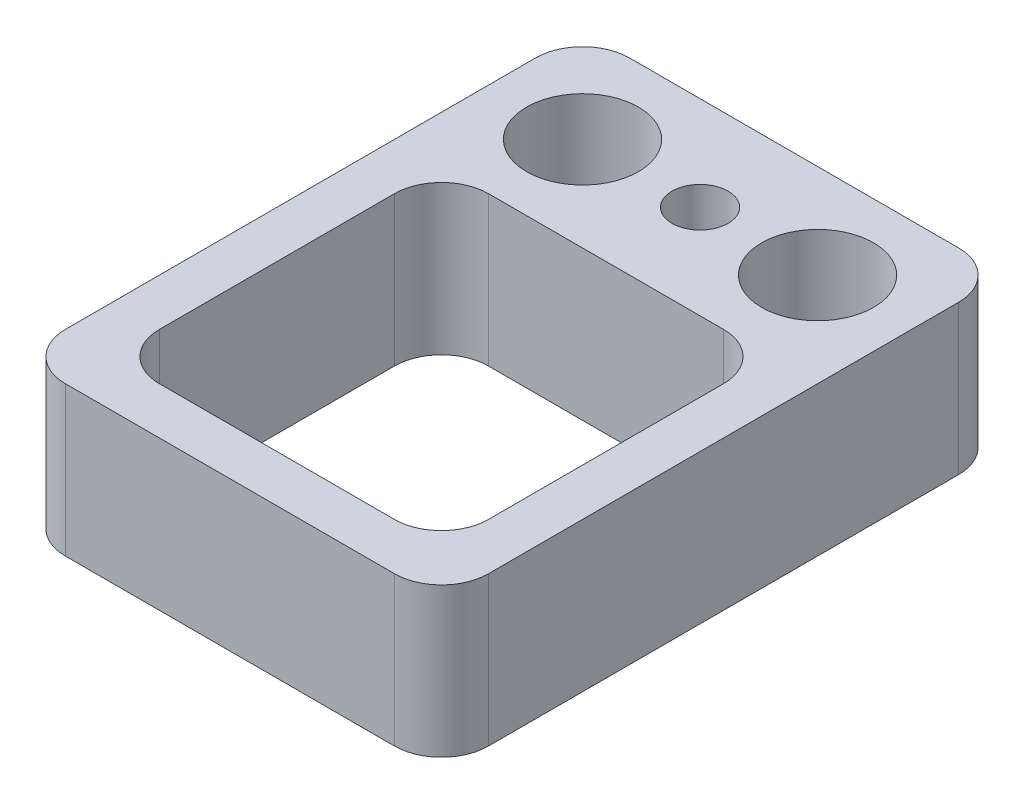
ISO-10303-21;
HEADER;
FILE_DESCRIPTION(('STEP AP214'),'2;1');
FILE_NAME('part.step','',(''),(''),'','','');
FILE_SCHEMA(('AUTOMOTIVE_DESIGN { 1 0 10303 214 1 1 1 1 }'));
ENDSEC;
DATA;
#1=APPLICATION_CONTEXT('core data for automotive mechanical design processes');
#2=APPLICATION_PROTOCOL_DEFINITION('international standard','automotive_design',2000,#1);
#3=PRODUCT_CONTEXT('',#1,'mechanical');
#4=PRODUCT('Part','Part','',(#3));
#5=PRODUCT_RELATED_PRODUCT_CATEGORY('part','',(#4));
#6=PRODUCT_DEFINITION_FORMATION('','',#4);
#7=PRODUCT_DEFINITION_CONTEXT('part definition',#1,'design');
#8=PRODUCT_DEFINITION('design','',#6,#7);
#9=PRODUCT_DEFINITION_SHAPE('','',#8);
#10=(LENGTH_UNIT() NAMED_UNIT(*) SI_UNIT(.MILLI.,.METRE.));
#11=(NAMED_UNIT(*) PLANE_ANGLE_UNIT() SI_UNIT($,.RADIAN.));
#12=(NAMED_UNIT(*) SI_UNIT($,.STERADIAN.) SOLID_ANGLE_UNIT());
#13=UNCERTAINTY_MEASURE_WITH_UNIT(LENGTH_MEASURE(1.E-05),#10,'distance_accuracy_value','');
#14=(GEOMETRIC_REPRESENTATION_CONTEXT(3) GLOBAL_UNCERTAINTY_ASSIGNED_CONTEXT((#13)) GLOBAL_UNIT_ASSIGNED_CONTEXT((#10,
#11,#12)) REPRESENTATION_CONTEXT('',''));
#15=CARTESIAN_POINT('',(0.,0.,0.));
#16=DIRECTION('',(0.,0.,1.));
#17=DIRECTION('',(1.,0.,0.));
#18=AXIS2_PLACEMENT_3D('',#15,#16,#17);
#19=CARTESIAN_POINT('',(-4.5,3.175,6.));
#20=DIRECTION('',(1.,0.,0.));
#21=DIRECTION('',(0.,0.,-1.));
#22=AXIS2_PLACEMENT_3D('',#19,#20,#21);
#23=PLANE('',#22);
#24=DIRECTION('',(0.,0.,1.));
#25=VECTOR('',#24,1.);
#26=CARTESIAN_POINT('',(-4.5,0.,6.));
#27=LINE('',#26,#25);
#28=CARTESIAN_POINT('',(-4.5,0.,-5.));
#29=VERTEX_POINT('',#28);
#30=CARTESIAN_POINT('',(-4.5,0.,5.));
#31=VERTEX_POINT('',#30);
#32=EDGE_CURVE('E184',#29,#31,#27,.T.);
#33=ORIENTED_EDGE('',*,*,#32,.T.);
#34=DIRECTION('',(0.,-1.,0.));
#35=VECTOR('',#34,1.);
#36=CARTESIAN_POINT('',(-4.5,3.175,5.));
#37=LINE('',#36,#35);
#38=CARTESIAN_POINT('',(-4.5,3.175,5.));
#39=VERTEX_POINT('',#38);
#40=EDGE_CURVE('E256',#31,#39,#37,.F.);
#41=ORIENTED_EDGE('',*,*,#40,.T.);
#42=DIRECTION('',(0.,0.,1.));
#43=VECTOR('',#42,1.);
#44=CARTESIAN_POINT('',(-4.5,3.175,6.));
#45=LINE('',#44,#43);
#46=CARTESIAN_POINT('',(-4.5,3.175,-5.));
#47=VERTEX_POINT('',#46);
#48=EDGE_CURVE('E185',#47,#39,#45,.T.);
#49=ORIENTED_EDGE('',*,*,#48,.F.);
#50=DIRECTION('',(0.,-1.,0.));
#51=VECTOR('',#50,1.);
#52=CARTESIAN_POINT('',(-4.5,3.175,-5.));
#53=LINE('',#52,#51);
#54=EDGE_CURVE('E253',#47,#29,#53,.T.);
#55=ORIENTED_EDGE('',*,*,#54,.T.);
#56=EDGE_LOOP('',(#33,#41,#49,#55));
#57=FACE_BOUND('',#56,.T.);
#58=ADVANCED_FACE('F31',(#57),#23,.F.);
#59=CARTESIAN_POINT('',(4.5,3.175,6.));
#60=DIRECTION('',(0.,0.,-1.));
#61=DIRECTION('',(-1.,0.,0.));
#62=AXIS2_PLACEMENT_3D('',#59,#60,#61);
#63=PLANE('',#62);
#64=DIRECTION('',(1.,0.,0.));
#65=VECTOR('',#64,1.);
#66=CARTESIAN_POINT('',(4.5,3.175,6.));
#67=LINE('',#66,#65);
#68=CARTESIAN_POINT('',(-3.5,3.175,6.));
#69=VERTEX_POINT('',#68);
#70=CARTESIAN_POINT('',(3.5,3.175,6.));
#71=VERTEX_POINT('',#70);
#72=EDGE_CURVE('E188',#69,#71,#67,.T.);
#73=ORIENTED_EDGE('',*,*,#72,.F.);
#74=DIRECTION('',(0.,-1.,0.));
#75=VECTOR('',#74,1.);
#76=CARTESIAN_POINT('',(-3.5,3.175,6.));
#77=LINE('',#76,#75);
#78=CARTESIAN_POINT('',(-3.5,0.,6.));
#79=VERTEX_POINT('',#78);
#80=EDGE_CURVE('E242',#69,#79,#77,.T.);
#81=ORIENTED_EDGE('',*,*,#80,.T.);
#82=DIRECTION('',(1.,0.,0.));
#83=VECTOR('',#82,1.);
#84=CARTESIAN_POINT('',(4.5,0.,6.));
#85=LINE('',#84,#83);
#86=CARTESIAN_POINT('',(3.5,0.,6.));
#87=VERTEX_POINT('',#86);
#88=EDGE_CURVE('E198',#79,#87,#85,.T.);
#89=ORIENTED_EDGE('',*,*,#88,.T.);
#90=DIRECTION('',(0.,-1.,0.));
#91=VECTOR('',#90,1.);
#92=CARTESIAN_POINT('',(3.5,3.175,6.));
#93=LINE('',#92,#91);
#94=EDGE_CURVE('E240',#87,#71,#93,.F.);
#95=ORIENTED_EDGE('',*,*,#94,.T.);
#96=EDGE_LOOP('',(#73,#81,#89,#95));
#97=FACE_BOUND('',#96,.T.);
#98=ADVANCED_FACE('F309',(#97),#63,.F.);
#99=CARTESIAN_POINT('',(4.5,3.175,6.));
#100=DIRECTION('',(-1.,0.,0.));
#101=DIRECTION('',(0.,0.,1.));
#102=AXIS2_PLACEMENT_3D('',#99,#100,#101);
#103=PLANE('',#102);
#104=DIRECTION('',(0.,0.,-1.));
#105=VECTOR('',#104,1.);
#106=CARTESIAN_POINT('',(4.5,3.175,6.));
#107=LINE('',#106,#105);
#108=CARTESIAN_POINT('',(4.5,3.175,5.));
#109=VERTEX_POINT('',#108);
#110=CARTESIAN_POINT('',(4.5,3.175,-5.));
#111=VERTEX_POINT('',#110);
#112=EDGE_CURVE('E192',#109,#111,#107,.T.);
#113=ORIENTED_EDGE('',*,*,#112,.F.);
#114=DIRECTION('',(0.,-1.,0.));
#115=VECTOR('',#114,1.);
#116=CARTESIAN_POINT('',(4.5,3.175,5.));
#117=LINE('',#116,#115);
#118=CARTESIAN_POINT('',(4.5,0.,5.));
#119=VERTEX_POINT('',#118);
#120=EDGE_CURVE('E267',#109,#119,#117,.T.);
#121=ORIENTED_EDGE('',*,*,#120,.T.);
#122=DIRECTION('',(0.,0.,-1.));
#123=VECTOR('',#122,1.);
#124=CARTESIAN_POINT('',(4.5,0.,6.));
#125=LINE('',#124,#123);
#126=CARTESIAN_POINT('',(4.5,0.,-5.));
#127=VERTEX_POINT('',#126);
#128=EDGE_CURVE('E201',#119,#127,#125,.T.);
#129=ORIENTED_EDGE('',*,*,#128,.T.);
#130=DIRECTION('',(0.,-1.,0.));
#131=VECTOR('',#130,1.);
#132=CARTESIAN_POINT('',(4.5,3.175,-5.));
#133=LINE('',#132,#131);
#134=EDGE_CURVE('E265',#127,#111,#133,.F.);
#135=ORIENTED_EDGE('',*,*,#134,.T.);
#136=EDGE_LOOP('',(#113,#121,#129,#135));
#137=FACE_BOUND('',#136,.T.);
#138=ADVANCED_FACE('F315',(#137),#103,.F.);
#139=CARTESIAN_POINT('',(4.5,3.175,-6.));
#140=DIRECTION('',(0.,0.,1.));
#141=DIRECTION('',(1.,0.,0.));
#142=AXIS2_PLACEMENT_3D('',#139,#140,#141);
#143=PLANE('',#142);
#144=DIRECTION('',(-1.,0.,0.));
#145=VECTOR('',#144,1.);
#146=CARTESIAN_POINT('',(4.5,3.175,-6.));
#147=LINE('',#146,#145);
#148=CARTESIAN_POINT('',(3.5,3.175,-6.));
#149=VERTEX_POINT('',#148);
#150=CARTESIAN_POINT('',(-3.5,3.175,-6.));
#151=VERTEX_POINT('',#150);
#152=EDGE_CURVE('E194',#149,#151,#147,.T.);
#153=ORIENTED_EDGE('',*,*,#152,.F.);
#154=DIRECTION('',(0.,-1.,0.));
#155=VECTOR('',#154,1.);
#156=CARTESIAN_POINT('',(3.5,3.175,-6.));
#157=LINE('',#156,#155);
#158=CARTESIAN_POINT('',(3.5,0.,-6.));
#159=VERTEX_POINT('',#158);
#160=EDGE_CURVE('E156',#149,#159,#157,.T.);
#161=ORIENTED_EDGE('',*,*,#160,.T.);
#162=DIRECTION('',(-1.,0.,0.));
#163=VECTOR('',#162,1.);
#164=CARTESIAN_POINT('',(4.5,0.,-6.));
#165=LINE('',#164,#163);
#166=CARTESIAN_POINT('',(-3.5,0.,-6.));
#167=VERTEX_POINT('',#166);
#168=EDGE_CURVE('E189',#159,#167,#165,.T.);
#169=ORIENTED_EDGE('',*,*,#168,.T.);
#170=DIRECTION('',(0.,-1.,0.));
#171=VECTOR('',#170,1.);
#172=CARTESIAN_POINT('',(-3.5,3.175,-6.));
#173=LINE('',#172,#171);
#174=EDGE_CURVE('E46',#167,#151,#173,.F.);
#175=ORIENTED_EDGE('',*,*,#174,.T.);
#176=EDGE_LOOP('',(#153,#161,#169,#175));
#177=FACE_BOUND('',#176,.T.);
#178=ADVANCED_FACE('F350',(#177),#143,.F.);
#179=CARTESIAN_POINT('',(-4.5,3.175,-6.));
#180=DIRECTION('',(0.,1.,0.));
#181=DIRECTION('',(0.,0.,1.));
#182=AXIS2_PLACEMENT_3D('',#179,#180,#181);
#183=PLANE('',#182);
#184=CARTESIAN_POINT('',(-2.5,3.175,-4.));
#185=DIRECTION('',(0.,1.,0.));
#186=DIRECTION('',(0.,0.,1.));
#187=AXIS2_PLACEMENT_3D('',#184,#185,#186);
#188=CIRCLE('',#187,1.190625);
#189=CARTESIAN_POINT('',(-2.5,3.175,-2.809375));
#190=VERTEX_POINT('',#189);
#191=EDGE_CURVE('E225',#190,#190,#188,.T.);
#192=ORIENTED_EDGE('',*,*,#191,.F.);
#193=EDGE_LOOP('',(#192));
#194=FACE_BOUND('',#193,.T.);
#195=CARTESIAN_POINT('',(2.5,3.175,-4.));
#196=DIRECTION('',(0.,1.,0.));
#197=DIRECTION('',(0.,0.,1.));
#198=AXIS2_PLACEMENT_3D('',#195,#196,#197);
#199=CIRCLE('',#198,1.190625);
#200=CARTESIAN_POINT('',(2.5,3.175,-2.809375));
#201=VERTEX_POINT('',#200);
#202=EDGE_CURVE('E221',#201,#201,#199,.T.);
#203=ORIENTED_EDGE('',*,*,#202,.F.);
#204=EDGE_LOOP('',(#203));
#205=FACE_BOUND('',#204,.T.);
#206=CARTESIAN_POINT('',(0.,3.175,-4.));
#207=DIRECTION('',(0.,1.,0.));
#208=DIRECTION('',(0.,0.,1.));
#209=AXIS2_PLACEMENT_3D('',#206,#207,#208);
#210=CIRCLE('',#209,0.595629999999999);
#211=CARTESIAN_POINT('',(0.,3.175,-3.40437));
#212=VERTEX_POINT('',#211);
#213=EDGE_CURVE('E217',#212,#212,#210,.T.);
#214=ORIENTED_EDGE('',*,*,#213,.F.);
#215=EDGE_LOOP('',(#214));
#216=FACE_BOUND('',#215,.T.);
#217=DIRECTION('',(0.,0.,1.));
#218=VECTOR('',#217,1.);
#219=CARTESIAN_POINT('',(-3.5,3.175,5.));
#220=LINE('',#219,#218);
#221=CARTESIAN_POINT('',(-3.5,3.175,-1.));
#222=VERTEX_POINT('',#221);
#223=CARTESIAN_POINT('',(-3.5,3.175,4.));
#224=VERTEX_POINT('',#223);
#225=EDGE_CURVE('E173',#222,#224,#220,.T.);
#226=ORIENTED_EDGE('',*,*,#225,.F.);
#227=CARTESIAN_POINT('',(-2.5,3.175,-1.));
#228=DIRECTION('',(0.,1.,0.));
#229=DIRECTION('',(0.,0.,1.));
#230=AXIS2_PLACEMENT_3D('',#227,#228,#229);
#231=CIRCLE('',#230,1.);
#232=CARTESIAN_POINT('',(-2.5,3.175,-2.));
#233=VERTEX_POINT('',#232);
#234=EDGE_CURVE('E39',#222,#233,#231,.F.);
#235=ORIENTED_EDGE('',*,*,#234,.T.);
#236=DIRECTION('',(-1.,0.,0.));
#237=VECTOR('',#236,1.);
#238=CARTESIAN_POINT('',(-3.5,3.175,-2.));
#239=LINE('',#238,#237);
#240=CARTESIAN_POINT('',(2.5,3.175,-2.));
#241=VERTEX_POINT('',#240);
#242=EDGE_CURVE('E176',#241,#233,#239,.T.);
#243=ORIENTED_EDGE('',*,*,#242,.F.);
#244=CARTESIAN_POINT('',(2.5,3.175,-1.));
#245=DIRECTION('',(0.,1.,0.));
#246=DIRECTION('',(0.,0.,1.));
#247=AXIS2_PLACEMENT_3D('',#244,#245,#246);
#248=CIRCLE('',#247,1.);
#249=CARTESIAN_POINT('',(3.5,3.175,-1.));
#250=VERTEX_POINT('',#249);
#251=EDGE_CURVE('E277',#241,#250,#248,.F.);
#252=ORIENTED_EDGE('',*,*,#251,.T.);
#253=DIRECTION('',(0.,0.,-1.));
#254=VECTOR('',#253,1.);
#255=CARTESIAN_POINT('',(3.5,3.175,5.));
#256=LINE('',#255,#254);
#257=CARTESIAN_POINT('',(3.5,3.175,4.));
#258=VERTEX_POINT('',#257);
#259=EDGE_CURVE('E172',#258,#250,#256,.T.);
#260=ORIENTED_EDGE('',*,*,#259,.F.);
#261=CARTESIAN_POINT('',(2.5,3.175,4.));
#262=DIRECTION('',(0.,1.,0.));
#263=DIRECTION('',(0.,0.,1.));
#264=AXIS2_PLACEMENT_3D('',#261,#262,#263);
#265=CIRCLE('',#264,1.);
#266=CARTESIAN_POINT('',(2.5,3.175,5.));
#267=VERTEX_POINT('',#266);
#268=EDGE_CURVE('E171',#258,#267,#265,.F.);
#269=ORIENTED_EDGE('',*,*,#268,.T.);
#270=DIRECTION('',(1.,0.,0.));
#271=VECTOR('',#270,1.);
#272=CARTESIAN_POINT('',(-3.5,3.175,5.));
#273=LINE('',#272,#271);
#274=CARTESIAN_POINT('',(-2.5,3.175,5.));
#275=VERTEX_POINT('',#274);
#276=EDGE_CURVE('E162',#275,#267,#273,.T.);
#277=ORIENTED_EDGE('',*,*,#276,.F.);
#278=CARTESIAN_POINT('',(-2.5,3.175,4.));
#279=DIRECTION('',(0.,1.,0.));
#280=DIRECTION('',(0.,0.,1.));
#281=AXIS2_PLACEMENT_3D('',#278,#279,#280);
#282=CIRCLE('',#281,1.);
#283=EDGE_CURVE('E145',#275,#224,#282,.F.);
#284=ORIENTED_EDGE('',*,*,#283,.T.);
#285=EDGE_LOOP('',(#226,#235,#243,#252,#260,#269,#277,#284));
#286=FACE_BOUND('',#285,.T.);
#287=ORIENTED_EDGE('',*,*,#48,.T.);
#288=CARTESIAN_POINT('',(-3.5,3.175,5.));
#289=DIRECTION('',(0.,1.,0.));
#290=DIRECTION('',(0.,0.,1.));
#291=AXIS2_PLACEMENT_3D('',#288,#289,#290);
#292=CIRCLE('',#291,1.);
#293=EDGE_CURVE('E263',#39,#69,#292,.T.);
#294=ORIENTED_EDGE('',*,*,#293,.T.);
#295=ORIENTED_EDGE('',*,*,#72,.T.);
#296=CARTESIAN_POINT('',(3.5,3.175,5.));
#297=DIRECTION('',(0.,1.,0.));
#298=DIRECTION('',(0.,0.,1.));
#299=AXIS2_PLACEMENT_3D('',#296,#297,#298);
#300=CIRCLE('',#299,1.);
#301=EDGE_CURVE('E261',#71,#109,#300,.T.);
#302=ORIENTED_EDGE('',*,*,#301,.T.);
#303=ORIENTED_EDGE('',*,*,#112,.T.);
#304=CARTESIAN_POINT('',(3.5,3.175,-5.));
#305=DIRECTION('',(0.,1.,0.));
#306=DIRECTION('',(0.,0.,1.));
#307=AXIS2_PLACEMENT_3D('',#304,#305,#306);
#308=CIRCLE('',#307,1.);
#309=EDGE_CURVE('E53',#111,#149,#308,.T.);
#310=ORIENTED_EDGE('',*,*,#309,.T.);
#311=ORIENTED_EDGE('',*,*,#152,.T.);
#312=CARTESIAN_POINT('',(-3.5,3.175,-5.));
#313=DIRECTION('',(0.,1.,0.));
#314=DIRECTION('',(0.,0.,1.));
#315=AXIS2_PLACEMENT_3D('',#312,#313,#314);
#316=CIRCLE('',#315,1.);
#317=EDGE_CURVE('E258',#151,#47,#316,.T.);
#318=ORIENTED_EDGE('',*,*,#317,.T.);
#319=EDGE_LOOP('',(#287,#294,#295,#302,#303,#310,#311,#318));
#320=FACE_BOUND('',#319,.T.);
#321=ADVANCED_FACE('F169',(#194,#205,#216,#286,#320),#183,.T.);
#322=CARTESIAN_POINT('',(-4.5,0.,-6.));
#323=DIRECTION('',(0.,1.,0.));
#324=DIRECTION('',(0.,0.,1.));
#325=AXIS2_PLACEMENT_3D('',#322,#323,#324);
#326=PLANE('',#325);
#327=CARTESIAN_POINT('',(-2.5,0.,-4.));
#328=DIRECTION('',(0.,1.,0.));
#329=DIRECTION('',(0.,0.,1.));
#330=AXIS2_PLACEMENT_3D('',#327,#328,#329);
#331=CIRCLE('',#330,1.190625);
#332=CARTESIAN_POINT('',(-2.5,0.,-2.809375));
#333=VERTEX_POINT('',#332);
#334=EDGE_CURVE('E222',#333,#333,#331,.T.);
#335=ORIENTED_EDGE('',*,*,#334,.T.);
#336=EDGE_LOOP('',(#335));
#337=FACE_BOUND('',#336,.T.);
#338=CARTESIAN_POINT('',(2.5,0.,-4.));
#339=DIRECTION('',(0.,1.,0.));
#340=DIRECTION('',(0.,0.,1.));
#341=AXIS2_PLACEMENT_3D('',#338,#339,#340);
#342=CIRCLE('',#341,1.190625);
#343=CARTESIAN_POINT('',(2.5,0.,-2.809375));
#344=VERTEX_POINT('',#343);
#345=EDGE_CURVE('E218',#344,#344,#342,.T.);
#346=ORIENTED_EDGE('',*,*,#345,.T.);
#347=EDGE_LOOP('',(#346));
#348=FACE_BOUND('',#347,.T.);
#349=CARTESIAN_POINT('',(0.,0.,-4.));
#350=DIRECTION('',(0.,1.,0.));
#351=DIRECTION('',(0.,0.,1.));
#352=AXIS2_PLACEMENT_3D('',#349,#350,#351);
#353=CIRCLE('',#352,0.595629999999999);
#354=CARTESIAN_POINT('',(0.,0.,-3.40437));
#355=VERTEX_POINT('',#354);
#356=EDGE_CURVE('E178',#355,#355,#353,.T.);
#357=ORIENTED_EDGE('',*,*,#356,.T.);
#358=EDGE_LOOP('',(#357));
#359=FACE_BOUND('',#358,.T.);
#360=DIRECTION('',(0.,0.,-1.));
#361=VECTOR('',#360,1.);
#362=CARTESIAN_POINT('',(3.5,0.,-6.));
#363=LINE('',#362,#361);
#364=CARTESIAN_POINT('',(3.5,0.,4.));
#365=VERTEX_POINT('',#364);
#366=CARTESIAN_POINT('',(3.5,0.,-1.));
#367=VERTEX_POINT('',#366);
#368=EDGE_CURVE('E206',#365,#367,#363,.T.);
#369=ORIENTED_EDGE('',*,*,#368,.T.);
#370=CARTESIAN_POINT('',(2.5,0.,-1.));
#371=DIRECTION('',(0.,1.,0.));
#372=DIRECTION('',(0.,0.,1.));
#373=AXIS2_PLACEMENT_3D('',#370,#371,#372);
#374=CIRCLE('',#373,1.);
#375=CARTESIAN_POINT('',(2.5,0.,-2.));
#376=VERTEX_POINT('',#375);
#377=EDGE_CURVE('E279',#367,#376,#374,.T.);
#378=ORIENTED_EDGE('',*,*,#377,.T.);
#379=DIRECTION('',(-1.,0.,0.));
#380=VECTOR('',#379,1.);
#381=CARTESIAN_POINT('',(-4.5,0.,-2.));
#382=LINE('',#381,#380);
#383=CARTESIAN_POINT('',(-2.5,0.,-2.));
#384=VERTEX_POINT('',#383);
#385=EDGE_CURVE('E209',#376,#384,#382,.T.);
#386=ORIENTED_EDGE('',*,*,#385,.T.);
#387=CARTESIAN_POINT('',(-2.5,0.,-1.));
#388=DIRECTION('',(0.,1.,0.));
#389=DIRECTION('',(0.,0.,1.));
#390=AXIS2_PLACEMENT_3D('',#387,#388,#389);
#391=CIRCLE('',#390,1.);
#392=CARTESIAN_POINT('',(-3.5,0.,-1.));
#393=VERTEX_POINT('',#392);
#394=EDGE_CURVE('E11',#384,#393,#391,.T.);
#395=ORIENTED_EDGE('',*,*,#394,.T.);
#396=DIRECTION('',(0.,0.,1.));
#397=VECTOR('',#396,1.);
#398=CARTESIAN_POINT('',(-3.5,0.,-6.));
#399=LINE('',#398,#397);
#400=CARTESIAN_POINT('',(-3.5,0.,4.));
#401=VERTEX_POINT('',#400);
#402=EDGE_CURVE('E212',#393,#401,#399,.T.);
#403=ORIENTED_EDGE('',*,*,#402,.T.);
#404=CARTESIAN_POINT('',(-2.5,0.,4.));
#405=DIRECTION('',(0.,1.,0.));
#406=DIRECTION('',(0.,0.,1.));
#407=AXIS2_PLACEMENT_3D('',#404,#405,#406);
#408=CIRCLE('',#407,1.);
#409=CARTESIAN_POINT('',(-2.5,0.,5.));
#410=VERTEX_POINT('',#409);
#411=EDGE_CURVE('E155',#401,#410,#408,.T.);
#412=ORIENTED_EDGE('',*,*,#411,.T.);
#413=DIRECTION('',(1.,0.,0.));
#414=VECTOR('',#413,1.);
#415=CARTESIAN_POINT('',(-4.5,0.,5.));
#416=LINE('',#415,#414);
#417=CARTESIAN_POINT('',(2.5,0.,5.));
#418=VERTEX_POINT('',#417);
#419=EDGE_CURVE('E165',#410,#418,#416,.T.);
#420=ORIENTED_EDGE('',*,*,#419,.T.);
#421=CARTESIAN_POINT('',(2.5,0.,4.));
#422=DIRECTION('',(0.,1.,0.));
#423=DIRECTION('',(0.,0.,1.));
#424=AXIS2_PLACEMENT_3D('',#421,#422,#423);
#425=CIRCLE('',#424,1.);
#426=EDGE_CURVE('E275',#418,#365,#425,.T.);
#427=ORIENTED_EDGE('',*,*,#426,.T.);
#428=EDGE_LOOP('',(#369,#378,#386,#395,#403,#412,#420,#427));
#429=FACE_BOUND('',#428,.T.);
#430=ORIENTED_EDGE('',*,*,#88,.F.);
#431=CARTESIAN_POINT('',(-3.5,0.,5.));
#432=DIRECTION('',(0.,1.,0.));
#433=DIRECTION('',(0.,0.,1.));
#434=AXIS2_PLACEMENT_3D('',#431,#432,#433);
#435=CIRCLE('',#434,1.);
#436=EDGE_CURVE('E251',#79,#31,#435,.F.);
#437=ORIENTED_EDGE('',*,*,#436,.T.);
#438=ORIENTED_EDGE('',*,*,#32,.F.);
#439=CARTESIAN_POINT('',(-3.5,0.,-5.));
#440=DIRECTION('',(0.,1.,0.));
#441=DIRECTION('',(0.,0.,1.));
#442=AXIS2_PLACEMENT_3D('',#439,#440,#441);
#443=CIRCLE('',#442,1.);
#444=EDGE_CURVE('E245',#29,#167,#443,.F.);
#445=ORIENTED_EDGE('',*,*,#444,.T.);
#446=ORIENTED_EDGE('',*,*,#168,.F.);
#447=CARTESIAN_POINT('',(3.5,0.,-5.));
#448=DIRECTION('',(0.,1.,0.));
#449=DIRECTION('',(0.,0.,1.));
#450=AXIS2_PLACEMENT_3D('',#447,#448,#449);
#451=CIRCLE('',#450,1.);
#452=EDGE_CURVE('E247',#159,#127,#451,.F.);
#453=ORIENTED_EDGE('',*,*,#452,.T.);
#454=ORIENTED_EDGE('',*,*,#128,.F.);
#455=CARTESIAN_POINT('',(3.5,0.,5.));
#456=DIRECTION('',(0.,1.,0.));
#457=DIRECTION('',(0.,0.,1.));
#458=AXIS2_PLACEMENT_3D('',#455,#456,#457);
#459=CIRCLE('',#458,1.);
#460=EDGE_CURVE('E249',#119,#87,#459,.F.);
#461=ORIENTED_EDGE('',*,*,#460,.T.);
#462=EDGE_LOOP('',(#430,#437,#438,#445,#446,#453,#454,#461));
#463=FACE_BOUND('',#462,.T.);
#464=ADVANCED_FACE('F292',(#337,#348,#359,#429,#463),#326,.F.);
#465=CARTESIAN_POINT('',(-3.5,-0.325,5.));
#466=DIRECTION('',(-1.,0.,0.));
#467=DIRECTION('',(0.,0.,1.));
#468=AXIS2_PLACEMENT_3D('',#465,#466,#467);
#469=PLANE('',#468);
#470=ORIENTED_EDGE('',*,*,#225,.T.);
#471=DIRECTION('',(0.,1.,0.));
#472=VECTOR('',#471,1.);
#473=CARTESIAN_POINT('',(-3.5,0.,4.));
#474=LINE('',#473,#472);
#475=EDGE_CURVE('E150',#224,#401,#474,.F.);
#476=ORIENTED_EDGE('',*,*,#475,.T.);
#477=ORIENTED_EDGE('',*,*,#402,.F.);
#478=DIRECTION('',(0.,1.,0.));
#479=VECTOR('',#478,1.);
#480=CARTESIAN_POINT('',(-3.5,3.175,-1.));
#481=LINE('',#480,#479);
#482=EDGE_CURVE('E166',#393,#222,#481,.T.);
#483=ORIENTED_EDGE('',*,*,#482,.T.);
#484=EDGE_LOOP('',(#470,#476,#477,#483));
#485=FACE_BOUND('',#484,.T.);
#486=ADVANCED_FACE('F295',(#485),#469,.F.);
#487=CARTESIAN_POINT('',(-3.5,-0.325,-2.));
#488=DIRECTION('',(0.,0.,-1.));
#489=DIRECTION('',(-1.,0.,0.));
#490=AXIS2_PLACEMENT_3D('',#487,#488,#489);
#491=PLANE('',#490);
#492=ORIENTED_EDGE('',*,*,#385,.F.);
#493=DIRECTION('',(0.,1.,0.));
#494=VECTOR('',#493,1.);
#495=CARTESIAN_POINT('',(2.5,3.175,-2.));
#496=LINE('',#495,#494);
#497=EDGE_CURVE('E237',#376,#241,#496,.T.);
#498=ORIENTED_EDGE('',*,*,#497,.T.);
#499=ORIENTED_EDGE('',*,*,#242,.T.);
#500=DIRECTION('',(0.,1.,0.));
#501=VECTOR('',#500,1.);
#502=CARTESIAN_POINT('',(-2.5,0.,-2.));
#503=LINE('',#502,#501);
#504=EDGE_CURVE('E235',#233,#384,#503,.F.);
#505=ORIENTED_EDGE('',*,*,#504,.T.);
#506=EDGE_LOOP('',(#492,#498,#499,#505));
#507=FACE_BOUND('',#506,.T.);
#508=ADVANCED_FACE('F286',(#507),#491,.F.);
#509=CARTESIAN_POINT('',(3.5,-0.325,5.));
#510=DIRECTION('',(1.,0.,0.));
#511=DIRECTION('',(0.,0.,-1.));
#512=AXIS2_PLACEMENT_3D('',#509,#510,#511);
#513=PLANE('',#512);
#514=ORIENTED_EDGE('',*,*,#368,.F.);
#515=DIRECTION('',(0.,1.,0.));
#516=VECTOR('',#515,1.);
#517=CARTESIAN_POINT('',(3.5,3.175,4.));
#518=LINE('',#517,#516);
#519=EDGE_CURVE('E232',#365,#258,#518,.T.);
#520=ORIENTED_EDGE('',*,*,#519,.T.);
#521=ORIENTED_EDGE('',*,*,#259,.T.);
#522=DIRECTION('',(0.,1.,0.));
#523=VECTOR('',#522,1.);
#524=CARTESIAN_POINT('',(3.5,0.,-1.));
#525=LINE('',#524,#523);
#526=EDGE_CURVE('E230',#250,#367,#525,.F.);
#527=ORIENTED_EDGE('',*,*,#526,.T.);
#528=EDGE_LOOP('',(#514,#520,#521,#527));
#529=FACE_BOUND('',#528,.T.);
#530=ADVANCED_FACE('F302',(#529),#513,.F.);
#531=CARTESIAN_POINT('',(-3.5,-0.325,5.));
#532=DIRECTION('',(0.,0.,1.));
#533=DIRECTION('',(1.,0.,0.));
#534=AXIS2_PLACEMENT_3D('',#531,#532,#533);
#535=PLANE('',#534);
#536=ORIENTED_EDGE('',*,*,#419,.F.);
#537=DIRECTION('',(0.,1.,0.));
#538=VECTOR('',#537,1.);
#539=CARTESIAN_POINT('',(-2.5,3.175,5.));
#540=LINE('',#539,#538);
#541=EDGE_CURVE('E149',#410,#275,#540,.T.);
#542=ORIENTED_EDGE('',*,*,#541,.T.);
#543=ORIENTED_EDGE('',*,*,#276,.T.);
#544=DIRECTION('',(0.,1.,0.));
#545=VECTOR('',#544,1.);
#546=CARTESIAN_POINT('',(2.5,0.,5.));
#547=LINE('',#546,#545);
#548=EDGE_CURVE('E167',#267,#418,#547,.F.);
#549=ORIENTED_EDGE('',*,*,#548,.T.);
#550=EDGE_LOOP('',(#536,#542,#543,#549));
#551=FACE_BOUND('',#550,.T.);
#552=ADVANCED_FACE('F161',(#551),#535,.F.);
#553=CARTESIAN_POINT('',(0.,3.175,-4.));
#554=DIRECTION('',(0.,1.,0.));
#555=DIRECTION('',(0.,0.,1.));
#556=AXIS2_PLACEMENT_3D('',#553,#554,#555);
#557=CYLINDRICAL_SURFACE('',#556,0.595629999999999);
#558=ORIENTED_EDGE('',*,*,#213,.T.);
#559=EDGE_LOOP('',(#558));
#560=FACE_BOUND('',#559,.T.);
#561=ORIENTED_EDGE('',*,*,#356,.F.);
#562=EDGE_LOOP('',(#561));
#563=FACE_BOUND('',#562,.T.);
#564=ADVANCED_FACE('F397',(#560,#563),#557,.F.);
#565=CARTESIAN_POINT('',(2.5,3.175,-4.));
#566=DIRECTION('',(0.,1.,0.));
#567=DIRECTION('',(0.,0.,1.));
#568=AXIS2_PLACEMENT_3D('',#565,#566,#567);
#569=CYLINDRICAL_SURFACE('',#568,1.190625);
#570=ORIENTED_EDGE('',*,*,#202,.T.);
#571=EDGE_LOOP('',(#570));
#572=FACE_BOUND('',#571,.T.);
#573=ORIENTED_EDGE('',*,*,#345,.F.);
#574=EDGE_LOOP('',(#573));
#575=FACE_BOUND('',#574,.T.);
#576=ADVANCED_FACE('F389',(#572,#575),#569,.F.);
#577=CARTESIAN_POINT('',(-2.5,3.175,-4.));
#578=DIRECTION('',(0.,1.,0.));
#579=DIRECTION('',(0.,0.,1.));
#580=AXIS2_PLACEMENT_3D('',#577,#578,#579);
#581=CYLINDRICAL_SURFACE('',#580,1.190625);
#582=ORIENTED_EDGE('',*,*,#191,.T.);
#583=EDGE_LOOP('',(#582));
#584=FACE_BOUND('',#583,.T.);
#585=ORIENTED_EDGE('',*,*,#334,.F.);
#586=EDGE_LOOP('',(#585));
#587=FACE_BOUND('',#586,.T.);
#588=ADVANCED_FACE('F323',(#584,#587),#581,.F.);
#589=CARTESIAN_POINT('',(-2.5,-0.325,4.));
#590=DIRECTION('',(0.,-1.,0.));
#591=DIRECTION('',(0.,0.,-1.));
#592=AXIS2_PLACEMENT_3D('',#589,#590,#591);
#593=CYLINDRICAL_SURFACE('',#592,1.);
#594=ORIENTED_EDGE('',*,*,#411,.F.);
#595=ORIENTED_EDGE('',*,*,#475,.F.);
#596=ORIENTED_EDGE('',*,*,#283,.F.);
#597=ORIENTED_EDGE('',*,*,#541,.F.);
#598=EDGE_LOOP('',(#594,#595,#596,#597));
#599=FACE_BOUND('',#598,.T.);
#600=ADVANCED_FACE('F148',(#599),#593,.F.);
#601=CARTESIAN_POINT('',(2.5,-0.325,4.));
#602=DIRECTION('',(0.,-1.,0.));
#603=DIRECTION('',(0.,0.,-1.));
#604=AXIS2_PLACEMENT_3D('',#601,#602,#603);
#605=CYLINDRICAL_SURFACE('',#604,1.);
#606=ORIENTED_EDGE('',*,*,#426,.F.);
#607=ORIENTED_EDGE('',*,*,#548,.F.);
#608=ORIENTED_EDGE('',*,*,#268,.F.);
#609=ORIENTED_EDGE('',*,*,#519,.F.);
#610=EDGE_LOOP('',(#606,#607,#608,#609));
#611=FACE_BOUND('',#610,.T.);
#612=ADVANCED_FACE('F322',(#611),#605,.F.);
#613=CARTESIAN_POINT('',(2.5,-0.325,-1.));
#614=DIRECTION('',(0.,-1.,0.));
#615=DIRECTION('',(0.,0.,-1.));
#616=AXIS2_PLACEMENT_3D('',#613,#614,#615);
#617=CYLINDRICAL_SURFACE('',#616,1.);
#618=ORIENTED_EDGE('',*,*,#377,.F.);
#619=ORIENTED_EDGE('',*,*,#526,.F.);
#620=ORIENTED_EDGE('',*,*,#251,.F.);
#621=ORIENTED_EDGE('',*,*,#497,.F.);
#622=EDGE_LOOP('',(#618,#619,#620,#621));
#623=FACE_BOUND('',#622,.T.);
#624=ADVANCED_FACE('F326',(#623),#617,.F.);
#625=CARTESIAN_POINT('',(-2.5,-0.325,-1.));
#626=DIRECTION('',(0.,-1.,0.));
#627=DIRECTION('',(0.,0.,-1.));
#628=AXIS2_PLACEMENT_3D('',#625,#626,#627);
#629=CYLINDRICAL_SURFACE('',#628,1.);
#630=ORIENTED_EDGE('',*,*,#394,.F.);
#631=ORIENTED_EDGE('',*,*,#504,.F.);
#632=ORIENTED_EDGE('',*,*,#234,.F.);
#633=ORIENTED_EDGE('',*,*,#482,.F.);
#634=EDGE_LOOP('',(#630,#631,#632,#633));
#635=FACE_BOUND('',#634,.T.);
#636=ADVANCED_FACE('F289',(#635),#629,.F.);
#637=CARTESIAN_POINT('',(-3.5,3.175,5.));
#638=DIRECTION('',(0.,-1.,0.));
#639=DIRECTION('',(0.,0.,-1.));
#640=AXIS2_PLACEMENT_3D('',#637,#638,#639);
#641=CYLINDRICAL_SURFACE('',#640,1.);
#642=ORIENTED_EDGE('',*,*,#293,.F.);
#643=ORIENTED_EDGE('',*,*,#40,.F.);
#644=ORIENTED_EDGE('',*,*,#436,.F.);
#645=ORIENTED_EDGE('',*,*,#80,.F.);
#646=EDGE_LOOP('',(#642,#643,#644,#645));
#647=FACE_BOUND('',#646,.T.);
#648=ADVANCED_FACE('F333',(#647),#641,.T.);
#649=CARTESIAN_POINT('',(3.5,3.175,5.));
#650=DIRECTION('',(0.,-1.,0.));
#651=DIRECTION('',(0.,0.,-1.));
#652=AXIS2_PLACEMENT_3D('',#649,#650,#651);
#653=CYLINDRICAL_SURFACE('',#652,1.);
#654=ORIENTED_EDGE('',*,*,#301,.F.);
#655=ORIENTED_EDGE('',*,*,#94,.F.);
#656=ORIENTED_EDGE('',*,*,#460,.F.);
#657=ORIENTED_EDGE('',*,*,#120,.F.);
#658=EDGE_LOOP('',(#654,#655,#656,#657));
#659=FACE_BOUND('',#658,.T.);
#660=ADVANCED_FACE('F336',(#659),#653,.T.);
#661=CARTESIAN_POINT('',(3.5,3.175,-5.));
#662=DIRECTION('',(0.,-1.,0.));
#663=DIRECTION('',(0.,0.,-1.));
#664=AXIS2_PLACEMENT_3D('',#661,#662,#663);
#665=CYLINDRICAL_SURFACE('',#664,1.);
#666=ORIENTED_EDGE('',*,*,#309,.F.);
#667=ORIENTED_EDGE('',*,*,#134,.F.);
#668=ORIENTED_EDGE('',*,*,#452,.F.);
#669=ORIENTED_EDGE('',*,*,#160,.F.);
#670=EDGE_LOOP('',(#666,#667,#668,#669));
#671=FACE_BOUND('',#670,.T.);
#672=ADVANCED_FACE('F339',(#671),#665,.T.);
#673=CARTESIAN_POINT('',(-3.5,3.175,-5.));
#674=DIRECTION('',(0.,-1.,0.));
#675=DIRECTION('',(0.,0.,-1.));
#676=AXIS2_PLACEMENT_3D('',#673,#674,#675);
#677=CYLINDRICAL_SURFACE('',#676,1.);
#678=ORIENTED_EDGE('',*,*,#317,.F.);
#679=ORIENTED_EDGE('',*,*,#174,.F.);
#680=ORIENTED_EDGE('',*,*,#444,.F.);
#681=ORIENTED_EDGE('',*,*,#54,.F.);
#682=EDGE_LOOP('',(#678,#679,#680,#681));
#683=FACE_BOUND('',#682,.T.);
#684=ADVANCED_FACE('F33',(#683),#677,.T.);
#685=CLOSED_SHELL('',(#58,#98,#138,#178,#321,#464,#486,#508,#530,#552,#564,#576,#588,#600,#612,
#624,#636,#648,#660,#672,#684));
#686=MANIFOLD_SOLID_BREP('B2',#685);
#687=ADVANCED_BREP_SHAPE_REPRESENTATION('',(#18,#686),#14);
#688=SHAPE_DEFINITION_REPRESENTATION(#9,#687);
ENDSEC;
END-ISO-10303-21;
